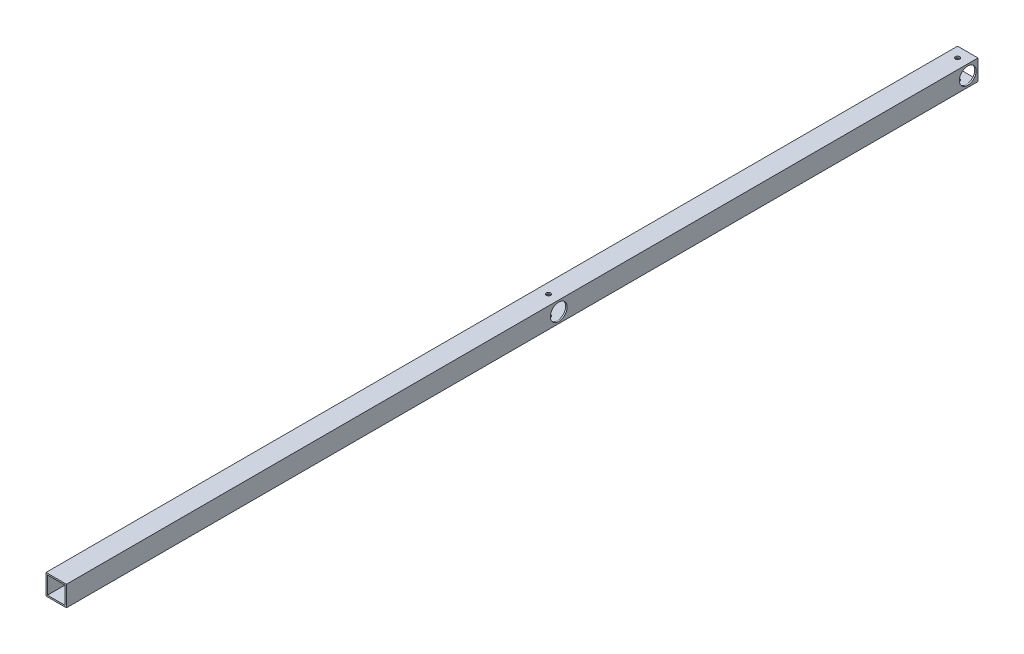
ISO-10303-21;
HEADER;
FILE_DESCRIPTION(('STEP AP214'),'2;1');
FILE_NAME('part.step','',(''),(''),'','','');
FILE_SCHEMA(('AUTOMOTIVE_DESIGN { 1 0 10303 214 1 1 1 1 }'));
ENDSEC;
DATA;
#1=APPLICATION_CONTEXT('core data for automotive mechanical design processes');
#2=APPLICATION_PROTOCOL_DEFINITION('international standard','automotive_design',2000,#1);
#3=PRODUCT_CONTEXT('',#1,'mechanical');
#4=PRODUCT('Part','Part','',(#3));
#5=PRODUCT_RELATED_PRODUCT_CATEGORY('part','',(#4));
#6=PRODUCT_DEFINITION_FORMATION('','',#4);
#7=PRODUCT_DEFINITION_CONTEXT('part definition',#1,'design');
#8=PRODUCT_DEFINITION('design','',#6,#7);
#9=PRODUCT_DEFINITION_SHAPE('','',#8);
#10=(LENGTH_UNIT() NAMED_UNIT(*) SI_UNIT(.MILLI.,.METRE.));
#11=(NAMED_UNIT(*) PLANE_ANGLE_UNIT() SI_UNIT($,.RADIAN.));
#12=(NAMED_UNIT(*) SI_UNIT($,.STERADIAN.) SOLID_ANGLE_UNIT());
#13=UNCERTAINTY_MEASURE_WITH_UNIT(LENGTH_MEASURE(1.E-05),#10,'distance_accuracy_value','');
#14=(GEOMETRIC_REPRESENTATION_CONTEXT(3) GLOBAL_UNCERTAINTY_ASSIGNED_CONTEXT((#13)) GLOBAL_UNIT_ASSIGNED_CONTEXT((#10,
#11,#12)) REPRESENTATION_CONTEXT('',''));
#15=CARTESIAN_POINT('',(0.,0.,0.));
#16=DIRECTION('',(0.,0.,1.));
#17=DIRECTION('',(1.,0.,0.));
#18=AXIS2_PLACEMENT_3D('',#15,#16,#17);
#19=CARTESIAN_POINT('',(-9.09282899069231,22.4806190747695,911.225));
#20=DIRECTION('',(0.,-1.,0.));
#21=DIRECTION('',(0.,0.,-1.));
#22=AXIS2_PLACEMENT_3D('',#19,#20,#21);
#23=CYLINDRICAL_SURFACE('',#22,4.7625);
#24=CARTESIAN_POINT('',(-9.09282899069231,22.4806190747695,911.225));
#25=DIRECTION('',(0.,-1.,0.));
#26=DIRECTION('',(0.,0.,-1.));
#27=AXIS2_PLACEMENT_3D('',#24,#25,#26);
#28=CIRCLE('',#27,4.7625);
#29=CARTESIAN_POINT('',(-9.09282899069231,22.4806190747695,906.4625));
#30=VERTEX_POINT('',#29);
#31=EDGE_CURVE('E152',#30,#30,#28,.T.);
#32=ORIENTED_EDGE('',*,*,#31,.F.);
#33=EDGE_LOOP('',(#32));
#34=FACE_BOUND('',#33,.T.);
#35=CARTESIAN_POINT('',(-9.09282899069231,19.3056190747695,911.225));
#36=DIRECTION('',(0.,-1.,0.));
#37=DIRECTION('',(0.,0.,-1.));
#38=AXIS2_PLACEMENT_3D('',#35,#36,#37);
#39=CIRCLE('',#38,4.7625);
#40=CARTESIAN_POINT('',(-9.09282899069231,19.3056190747695,906.4625));
#41=VERTEX_POINT('',#40);
#42=EDGE_CURVE('E20',#41,#41,#39,.T.);
#43=ORIENTED_EDGE('',*,*,#42,.T.);
#44=EDGE_LOOP('',(#43));
#45=FACE_BOUND('',#44,.T.);
#46=ADVANCED_FACE('F17',(#34,#45),#23,.F.);
#47=CARTESIAN_POINT('',(-9.09282899069231,22.4806190747695,22.2250000000001));
#48=DIRECTION('',(0.,-1.,0.));
#49=DIRECTION('',(0.,0.,-1.));
#50=AXIS2_PLACEMENT_3D('',#47,#48,#49);
#51=CYLINDRICAL_SURFACE('',#50,4.7625);
#52=CARTESIAN_POINT('',(-9.09282899069231,22.4806190747695,22.2250000000001));
#53=DIRECTION('',(0.,-1.,0.));
#54=DIRECTION('',(0.,0.,-1.));
#55=AXIS2_PLACEMENT_3D('',#52,#53,#54);
#56=CIRCLE('',#55,4.7625);
#57=CARTESIAN_POINT('',(-9.09282899069231,22.4806190747695,17.4625000000001));
#58=VERTEX_POINT('',#57);
#59=EDGE_CURVE('E149',#58,#58,#56,.T.);
#60=ORIENTED_EDGE('',*,*,#59,.F.);
#61=EDGE_LOOP('',(#60));
#62=FACE_BOUND('',#61,.T.);
#63=CARTESIAN_POINT('',(-9.09282899069231,19.3056190747695,22.2250000000001));
#64=DIRECTION('',(0.,-1.,0.));
#65=DIRECTION('',(0.,0.,-1.));
#66=AXIS2_PLACEMENT_3D('',#63,#64,#65);
#67=CIRCLE('',#66,4.7625);
#68=CARTESIAN_POINT('',(-9.09282899069231,19.3056190747695,17.4625000000001));
#69=VERTEX_POINT('',#68);
#70=EDGE_CURVE('E116',#69,#69,#67,.T.);
#71=ORIENTED_EDGE('',*,*,#70,.T.);
#72=EDGE_LOOP('',(#71));
#73=FACE_BOUND('',#72,.T.);
#74=ADVANCED_FACE('F283',(#62,#73),#51,.F.);
#75=CARTESIAN_POINT('',(13.1321710093077,0.25561907476954,911.225));
#76=DIRECTION('',(-1.,0.,0.));
#77=DIRECTION('',(0.,-1.,0.));
#78=AXIS2_PLACEMENT_3D('',#75,#76,#77);
#79=CYLINDRICAL_SURFACE('',#78,18.25625);
#80=CARTESIAN_POINT('',(9.95717100930769,0.25561907476954,911.225));
#81=DIRECTION('',(-1.,0.,0.));
#82=DIRECTION('',(0.,-1.,0.));
#83=AXIS2_PLACEMENT_3D('',#80,#81,#82);
#84=CIRCLE('',#83,18.25625);
#85=CARTESIAN_POINT('',(9.95717100930769,-18.0006309252305,911.225));
#86=VERTEX_POINT('',#85);
#87=EDGE_CURVE('E115',#86,#86,#84,.T.);
#88=ORIENTED_EDGE('',*,*,#87,.T.);
#89=EDGE_LOOP('',(#88));
#90=FACE_BOUND('',#89,.T.);
#91=CARTESIAN_POINT('',(13.1321710093077,0.25561907476954,911.225));
#92=DIRECTION('',(-1.,0.,0.));
#93=DIRECTION('',(0.,-1.,0.));
#94=AXIS2_PLACEMENT_3D('',#91,#92,#93);
#95=CIRCLE('',#94,18.25625);
#96=CARTESIAN_POINT('',(13.1321710093077,-18.0006309252305,911.225));
#97=VERTEX_POINT('',#96);
#98=EDGE_CURVE('E140',#97,#97,#95,.T.);
#99=ORIENTED_EDGE('',*,*,#98,.F.);
#100=EDGE_LOOP('',(#99));
#101=FACE_BOUND('',#100,.T.);
#102=ADVANCED_FACE('F280',(#90,#101),#79,.F.);
#103=CARTESIAN_POINT('',(13.1321710093077,0.25561907476954,22.225));
#104=DIRECTION('',(-1.,0.,0.));
#105=DIRECTION('',(0.,-1.,0.));
#106=AXIS2_PLACEMENT_3D('',#103,#104,#105);
#107=CYLINDRICAL_SURFACE('',#106,18.25625);
#108=CARTESIAN_POINT('',(9.95717100930769,0.25561907476954,22.225));
#109=DIRECTION('',(-1.,0.,0.));
#110=DIRECTION('',(0.,-1.,0.));
#111=AXIS2_PLACEMENT_3D('',#108,#109,#110);
#112=CIRCLE('',#111,18.25625);
#113=CARTESIAN_POINT('',(9.95717100930769,-18.0006309252305,22.225));
#114=VERTEX_POINT('',#113);
#115=EDGE_CURVE('E155',#114,#114,#112,.T.);
#116=ORIENTED_EDGE('',*,*,#115,.T.);
#117=EDGE_LOOP('',(#116));
#118=FACE_BOUND('',#117,.T.);
#119=CARTESIAN_POINT('',(13.1321710093077,0.25561907476954,22.225));
#120=DIRECTION('',(-1.,0.,0.));
#121=DIRECTION('',(0.,-1.,0.));
#122=AXIS2_PLACEMENT_3D('',#119,#120,#121);
#123=CIRCLE('',#122,18.25625);
#124=CARTESIAN_POINT('',(13.1321710093077,-18.0006309252305,22.225));
#125=VERTEX_POINT('',#124);
#126=EDGE_CURVE('E136',#125,#125,#123,.T.);
#127=ORIENTED_EDGE('',*,*,#126,.F.);
#128=EDGE_LOOP('',(#127));
#129=FACE_BOUND('',#128,.T.);
#130=ADVANCED_FACE('F276',(#118,#129),#107,.F.);
#131=CARTESIAN_POINT('',(-28.1428289906922,-21.9693809252305,0.));
#132=DIRECTION('',(-1.,0.,0.));
#133=DIRECTION('',(0.,0.,1.));
#134=AXIS2_PLACEMENT_3D('',#131,#132,#133);
#135=PLANE('',#134);
#136=CARTESIAN_POINT('',(-28.1428289906922,0.255619074769538,22.225));
#137=DIRECTION('',(-1.,0.,0.));
#138=DIRECTION('',(0.,-1.,0.));
#139=AXIS2_PLACEMENT_3D('',#136,#137,#138);
#140=CIRCLE('',#139,18.25625);
#141=CARTESIAN_POINT('',(-28.1428289906922,-18.0006309252305,22.225));
#142=VERTEX_POINT('',#141);
#143=EDGE_CURVE('E113',#142,#142,#140,.T.);
#144=ORIENTED_EDGE('',*,*,#143,.T.);
#145=EDGE_LOOP('',(#144));
#146=FACE_BOUND('',#145,.T.);
#147=CARTESIAN_POINT('',(-28.1428289906922,0.255619074769538,911.225));
#148=DIRECTION('',(-1.,0.,0.));
#149=DIRECTION('',(0.,-1.,0.));
#150=AXIS2_PLACEMENT_3D('',#147,#148,#149);
#151=CIRCLE('',#150,18.25625);
#152=CARTESIAN_POINT('',(-28.1428289906922,-18.0006309252305,911.225));
#153=VERTEX_POINT('',#152);
#154=EDGE_CURVE('E146',#153,#153,#151,.T.);
#155=ORIENTED_EDGE('',*,*,#154,.T.);
#156=EDGE_LOOP('',(#155));
#157=FACE_BOUND('',#156,.T.);
#158=DIRECTION('',(0.,1.,0.));
#159=VECTOR('',#158,1.);
#160=CARTESIAN_POINT('',(-28.1428289906922,0.25561907476954,0.));
#161=LINE('',#160,#159);
#162=CARTESIAN_POINT('',(-28.1428289906922,-18.7943809252305,0.));
#163=VERTEX_POINT('',#162);
#164=CARTESIAN_POINT('',(-28.1428289906922,19.3056190747695,0.));
#165=VERTEX_POINT('',#164);
#166=EDGE_CURVE('E105',#163,#165,#161,.T.);
#167=ORIENTED_EDGE('',*,*,#166,.T.);
#168=DIRECTION('',(0.,0.,1.));
#169=VECTOR('',#168,1.);
#170=CARTESIAN_POINT('',(-28.1428289906922,19.3056190747695,0.));
#171=LINE('',#170,#169);
#172=CARTESIAN_POINT('',(-28.1428289906922,19.3056190747695,1981.2));
#173=VERTEX_POINT('',#172);
#174=EDGE_CURVE('E117',#165,#173,#171,.T.);
#175=ORIENTED_EDGE('',*,*,#174,.T.);
#176=DIRECTION('',(0.,1.,0.));
#177=VECTOR('',#176,1.);
#178=CARTESIAN_POINT('',(-28.1428289906922,0.25561907476954,1981.2));
#179=LINE('',#178,#177);
#180=CARTESIAN_POINT('',(-28.1428289906922,-18.7943809252305,1981.2));
#181=VERTEX_POINT('',#180);
#182=EDGE_CURVE('E183',#181,#173,#179,.T.);
#183=ORIENTED_EDGE('',*,*,#182,.F.);
#184=DIRECTION('',(0.,0.,-1.));
#185=VECTOR('',#184,1.);
#186=CARTESIAN_POINT('',(-28.1428289906922,-18.7943809252305,0.));
#187=LINE('',#186,#185);
#188=EDGE_CURVE('E101',#181,#163,#187,.T.);
#189=ORIENTED_EDGE('',*,*,#188,.T.);
#190=EDGE_LOOP('',(#167,#175,#183,#189));
#191=FACE_BOUND('',#190,.T.);
#192=ADVANCED_FACE('F169',(#146,#157,#191),#135,.F.);
#193=CARTESIAN_POINT('',(-31.3178289906922,19.3056190747695,0.));
#194=DIRECTION('',(0.,1.,0.));
#195=DIRECTION('',(0.,0.,1.));
#196=AXIS2_PLACEMENT_3D('',#193,#194,#195);
#197=PLANE('',#196);
#198=ORIENTED_EDGE('',*,*,#70,.F.);
#199=EDGE_LOOP('',(#198));
#200=FACE_BOUND('',#199,.T.);
#201=ORIENTED_EDGE('',*,*,#42,.F.);
#202=EDGE_LOOP('',(#201));
#203=FACE_BOUND('',#202,.T.);
#204=DIRECTION('',(1.,0.,0.));
#205=VECTOR('',#204,1.);
#206=CARTESIAN_POINT('',(-9.09282899069231,19.3056190747695,0.));
#207=LINE('',#206,#205);
#208=CARTESIAN_POINT('',(9.95717100930769,19.3056190747695,0.));
#209=VERTEX_POINT('',#208);
#210=EDGE_CURVE('E107',#165,#209,#207,.T.);
#211=ORIENTED_EDGE('',*,*,#210,.T.);
#212=DIRECTION('',(0.,0.,-1.));
#213=VECTOR('',#212,1.);
#214=CARTESIAN_POINT('',(9.95717100930769,19.3056190747695,0.));
#215=LINE('',#214,#213);
#216=CARTESIAN_POINT('',(9.95717100930769,19.3056190747695,1981.2));
#217=VERTEX_POINT('',#216);
#218=EDGE_CURVE('E79',#209,#217,#215,.F.);
#219=ORIENTED_EDGE('',*,*,#218,.T.);
#220=DIRECTION('',(1.,0.,0.));
#221=VECTOR('',#220,1.);
#222=CARTESIAN_POINT('',(-9.09282899069231,19.3056190747695,1981.2));
#223=LINE('',#222,#221);
#224=EDGE_CURVE('E186',#173,#217,#223,.T.);
#225=ORIENTED_EDGE('',*,*,#224,.F.);
#226=ORIENTED_EDGE('',*,*,#174,.F.);
#227=EDGE_LOOP('',(#211,#219,#225,#226));
#228=FACE_BOUND('',#227,.T.);
#229=ADVANCED_FACE('F166',(#200,#203,#228),#197,.F.);
#230=CARTESIAN_POINT('',(9.95717100930769,22.4806190747695,0.));
#231=DIRECTION('',(1.,0.,0.));
#232=DIRECTION('',(0.,0.,-1.));
#233=AXIS2_PLACEMENT_3D('',#230,#231,#232);
#234=PLANE('',#233);
#235=ORIENTED_EDGE('',*,*,#115,.F.);
#236=EDGE_LOOP('',(#235));
#237=FACE_BOUND('',#236,.T.);
#238=ORIENTED_EDGE('',*,*,#87,.F.);
#239=EDGE_LOOP('',(#238));
#240=FACE_BOUND('',#239,.T.);
#241=DIRECTION('',(0.,1.,0.));
#242=VECTOR('',#241,1.);
#243=CARTESIAN_POINT('',(9.95717100930769,0.25561907476954,0.));
#244=LINE('',#243,#242);
#245=CARTESIAN_POINT('',(9.95717100930769,-18.7943809252305,0.));
#246=VERTEX_POINT('',#245);
#247=EDGE_CURVE('E82',#209,#246,#244,.F.);
#248=ORIENTED_EDGE('',*,*,#247,.T.);
#249=DIRECTION('',(0.,0.,-1.));
#250=VECTOR('',#249,1.);
#251=CARTESIAN_POINT('',(9.95717100930769,-18.7943809252305,0.));
#252=LINE('',#251,#250);
#253=CARTESIAN_POINT('',(9.95717100930769,-18.7943809252305,1981.2));
#254=VERTEX_POINT('',#253);
#255=EDGE_CURVE('E85',#246,#254,#252,.F.);
#256=ORIENTED_EDGE('',*,*,#255,.T.);
#257=DIRECTION('',(0.,1.,0.));
#258=VECTOR('',#257,1.);
#259=CARTESIAN_POINT('',(9.95717100930769,0.25561907476954,1981.2));
#260=LINE('',#259,#258);
#261=EDGE_CURVE('E189',#217,#254,#260,.F.);
#262=ORIENTED_EDGE('',*,*,#261,.F.);
#263=ORIENTED_EDGE('',*,*,#218,.F.);
#264=EDGE_LOOP('',(#248,#256,#262,#263));
#265=FACE_BOUND('',#264,.T.);
#266=ADVANCED_FACE('F84',(#237,#240,#265),#234,.F.);
#267=CARTESIAN_POINT('',(-31.3178289906922,22.4806190747695,0.));
#268=DIRECTION('',(0.,1.,0.));
#269=DIRECTION('',(0.,0.,1.));
#270=AXIS2_PLACEMENT_3D('',#267,#268,#269);
#271=PLANE('',#270);
#272=ORIENTED_EDGE('',*,*,#59,.T.);
#273=EDGE_LOOP('',(#272));
#274=FACE_BOUND('',#273,.T.);
#275=ORIENTED_EDGE('',*,*,#31,.T.);
#276=EDGE_LOOP('',(#275));
#277=FACE_BOUND('',#276,.T.);
#278=DIRECTION('',(1.,0.,0.));
#279=VECTOR('',#278,1.);
#280=CARTESIAN_POINT('',(-9.09282899069231,22.4806190747695,1981.2));
#281=LINE('',#280,#279);
#282=CARTESIAN_POINT('',(13.1321710093077,22.4806190747695,1981.2));
#283=VERTEX_POINT('',#282);
#284=CARTESIAN_POINT('',(-31.3178289906922,22.4806190747695,1981.2));
#285=VERTEX_POINT('',#284);
#286=EDGE_CURVE('E181',#283,#285,#281,.F.);
#287=ORIENTED_EDGE('',*,*,#286,.F.);
#288=DIRECTION('',(0.,0.,-1.));
#289=VECTOR('',#288,1.);
#290=CARTESIAN_POINT('',(13.1321710093077,22.4806190747695,0.));
#291=LINE('',#290,#289);
#292=CARTESIAN_POINT('',(13.1321710093077,22.4806190747695,0.));
#293=VERTEX_POINT('',#292);
#294=EDGE_CURVE('E143',#293,#283,#291,.F.);
#295=ORIENTED_EDGE('',*,*,#294,.F.);
#296=DIRECTION('',(1.,0.,0.));
#297=VECTOR('',#296,1.);
#298=CARTESIAN_POINT('',(-9.09282899069231,22.4806190747695,0.));
#299=LINE('',#298,#297);
#300=CARTESIAN_POINT('',(-31.3178289906922,22.4806190747695,0.));
#301=VERTEX_POINT('',#300);
#302=EDGE_CURVE('E91',#293,#301,#299,.F.);
#303=ORIENTED_EDGE('',*,*,#302,.T.);
#304=DIRECTION('',(0.,0.,1.));
#305=VECTOR('',#304,1.);
#306=CARTESIAN_POINT('',(-31.3178289906922,22.4806190747695,0.));
#307=LINE('',#306,#305);
#308=EDGE_CURVE('E135',#285,#301,#307,.F.);
#309=ORIENTED_EDGE('',*,*,#308,.F.);
#310=EDGE_LOOP('',(#287,#295,#303,#309));
#311=FACE_BOUND('',#310,.T.);
#312=ADVANCED_FACE('F266',(#274,#277,#311),#271,.T.);
#313=CARTESIAN_POINT('',(13.1321710093077,0.25561907476954,911.225));
#314=DIRECTION('',(-1.,0.,0.));
#315=DIRECTION('',(0.,-1.,0.));
#316=AXIS2_PLACEMENT_3D('',#313,#314,#315);
#317=CYLINDRICAL_SURFACE('',#316,18.25625);
#318=CARTESIAN_POINT('',(-31.3178289906922,0.255619074769538,911.225));
#319=DIRECTION('',(-1.,0.,0.));
#320=DIRECTION('',(0.,-1.,0.));
#321=AXIS2_PLACEMENT_3D('',#318,#319,#320);
#322=CIRCLE('',#321,18.25625);
#323=CARTESIAN_POINT('',(-31.3178289906922,-18.0006309252305,911.225));
#324=VERTEX_POINT('',#323);
#325=EDGE_CURVE('E132',#324,#324,#322,.F.);
#326=ORIENTED_EDGE('',*,*,#325,.F.);
#327=EDGE_LOOP('',(#326));
#328=FACE_BOUND('',#327,.T.);
#329=ORIENTED_EDGE('',*,*,#154,.F.);
#330=EDGE_LOOP('',(#329));
#331=FACE_BOUND('',#330,.T.);
#332=ADVANCED_FACE('F260',(#328,#331),#317,.F.);
#333=CARTESIAN_POINT('',(13.1321710093077,0.25561907476954,22.225));
#334=DIRECTION('',(-1.,0.,0.));
#335=DIRECTION('',(0.,-1.,0.));
#336=AXIS2_PLACEMENT_3D('',#333,#334,#335);
#337=CYLINDRICAL_SURFACE('',#336,18.25625);
#338=CARTESIAN_POINT('',(-31.3178289906922,0.255619074769538,22.225));
#339=DIRECTION('',(-1.,0.,0.));
#340=DIRECTION('',(0.,-1.,0.));
#341=AXIS2_PLACEMENT_3D('',#338,#339,#340);
#342=CIRCLE('',#341,18.25625);
#343=CARTESIAN_POINT('',(-31.3178289906922,-18.0006309252305,22.225));
#344=VERTEX_POINT('',#343);
#345=EDGE_CURVE('E129',#344,#344,#342,.F.);
#346=ORIENTED_EDGE('',*,*,#345,.F.);
#347=EDGE_LOOP('',(#346));
#348=FACE_BOUND('',#347,.T.);
#349=ORIENTED_EDGE('',*,*,#143,.F.);
#350=EDGE_LOOP('',(#349));
#351=FACE_BOUND('',#350,.T.);
#352=ADVANCED_FACE('F252',(#348,#351),#337,.F.);
#353=CARTESIAN_POINT('',(13.1321710093077,-18.7943809252305,0.));
#354=DIRECTION('',(0.,-1.,0.));
#355=DIRECTION('',(0.,0.,-1.));
#356=AXIS2_PLACEMENT_3D('',#353,#354,#355);
#357=PLANE('',#356);
#358=CARTESIAN_POINT('',(-9.09282899069231,-18.7943809252305,22.2250000000001));
#359=DIRECTION('',(0.,-1.,0.));
#360=DIRECTION('',(0.,0.,-1.));
#361=AXIS2_PLACEMENT_3D('',#358,#359,#360);
#362=CIRCLE('',#361,4.7625);
#363=CARTESIAN_POINT('',(-9.09282899069231,-18.7943809252305,17.4625000000001));
#364=VERTEX_POINT('',#363);
#365=EDGE_CURVE('E122',#364,#364,#362,.T.);
#366=ORIENTED_EDGE('',*,*,#365,.T.);
#367=EDGE_LOOP('',(#366));
#368=FACE_BOUND('',#367,.T.);
#369=CARTESIAN_POINT('',(-9.09282899069231,-18.7943809252305,911.225));
#370=DIRECTION('',(0.,-1.,0.));
#371=DIRECTION('',(0.,0.,-1.));
#372=AXIS2_PLACEMENT_3D('',#369,#370,#371);
#373=CIRCLE('',#372,4.7625);
#374=CARTESIAN_POINT('',(-9.09282899069231,-18.7943809252305,906.4625));
#375=VERTEX_POINT('',#374);
#376=EDGE_CURVE('E126',#375,#375,#373,.T.);
#377=ORIENTED_EDGE('',*,*,#376,.T.);
#378=EDGE_LOOP('',(#377));
#379=FACE_BOUND('',#378,.T.);
#380=DIRECTION('',(1.,0.,0.));
#381=VECTOR('',#380,1.);
#382=CARTESIAN_POINT('',(-9.09282899069231,-18.7943809252305,0.));
#383=LINE('',#382,#381);
#384=EDGE_CURVE('E90',#246,#163,#383,.F.);
#385=ORIENTED_EDGE('',*,*,#384,.T.);
#386=ORIENTED_EDGE('',*,*,#188,.F.);
#387=DIRECTION('',(1.,0.,0.));
#388=VECTOR('',#387,1.);
#389=CARTESIAN_POINT('',(-9.09282899069231,-18.7943809252305,1981.2));
#390=LINE('',#389,#388);
#391=EDGE_CURVE('E99',#254,#181,#390,.F.);
#392=ORIENTED_EDGE('',*,*,#391,.F.);
#393=ORIENTED_EDGE('',*,*,#255,.F.);
#394=EDGE_LOOP('',(#385,#386,#392,#393));
#395=FACE_BOUND('',#394,.T.);
#396=ADVANCED_FACE('F95',(#368,#379,#395),#357,.F.);
#397=CARTESIAN_POINT('',(-9.09282899069231,0.25561907476954,0.));
#398=DIRECTION('',(0.,0.,1.));
#399=DIRECTION('',(1.,0.,0.));
#400=AXIS2_PLACEMENT_3D('',#397,#398,#399);
#401=PLANE('',#400);
#402=ORIENTED_EDGE('',*,*,#166,.F.);
#403=ORIENTED_EDGE('',*,*,#384,.F.);
#404=ORIENTED_EDGE('',*,*,#247,.F.);
#405=ORIENTED_EDGE('',*,*,#210,.F.);
#406=EDGE_LOOP('',(#402,#403,#404,#405));
#407=FACE_BOUND('',#406,.T.);
#408=DIRECTION('',(1.,0.,0.));
#409=VECTOR('',#408,1.);
#410=CARTESIAN_POINT('',(13.1321710093077,-21.9693809252305,0.));
#411=LINE('',#410,#409);
#412=CARTESIAN_POINT('',(-31.3178289906922,-21.9693809252305,0.));
#413=VERTEX_POINT('',#412);
#414=CARTESIAN_POINT('',(13.1321710093077,-21.9693809252305,0.));
#415=VERTEX_POINT('',#414);
#416=EDGE_CURVE('E125',#413,#415,#411,.T.);
#417=ORIENTED_EDGE('',*,*,#416,.F.);
#418=DIRECTION('',(0.,1.,0.));
#419=VECTOR('',#418,1.);
#420=CARTESIAN_POINT('',(-31.3178289906922,-21.9693809252305,0.));
#421=LINE('',#420,#419);
#422=EDGE_CURVE('E192',#301,#413,#421,.F.);
#423=ORIENTED_EDGE('',*,*,#422,.F.);
#424=ORIENTED_EDGE('',*,*,#302,.F.);
#425=DIRECTION('',(0.,1.,0.));
#426=VECTOR('',#425,1.);
#427=CARTESIAN_POINT('',(13.1321710093077,22.4806190747695,0.));
#428=LINE('',#427,#426);
#429=EDGE_CURVE('E174',#415,#293,#428,.T.);
#430=ORIENTED_EDGE('',*,*,#429,.F.);
#431=EDGE_LOOP('',(#417,#423,#424,#430));
#432=FACE_BOUND('',#431,.T.);
#433=ADVANCED_FACE('F103',(#407,#432),#401,.F.);
#434=CARTESIAN_POINT('',(13.1321710093077,22.4806190747695,0.));
#435=DIRECTION('',(1.,0.,0.));
#436=DIRECTION('',(0.,0.,-1.));
#437=AXIS2_PLACEMENT_3D('',#434,#435,#436);
#438=PLANE('',#437);
#439=ORIENTED_EDGE('',*,*,#126,.T.);
#440=EDGE_LOOP('',(#439));
#441=FACE_BOUND('',#440,.T.);
#442=ORIENTED_EDGE('',*,*,#98,.T.);
#443=EDGE_LOOP('',(#442));
#444=FACE_BOUND('',#443,.T.);
#445=DIRECTION('',(0.,1.,0.));
#446=VECTOR('',#445,1.);
#447=CARTESIAN_POINT('',(13.1321710093077,0.25561907476954,1981.2));
#448=LINE('',#447,#446);
#449=CARTESIAN_POINT('',(13.1321710093077,-21.9693809252305,1981.2));
#450=VERTEX_POINT('',#449);
#451=EDGE_CURVE('E139',#450,#283,#448,.T.);
#452=ORIENTED_EDGE('',*,*,#451,.F.);
#453=DIRECTION('',(0.,0.,-1.));
#454=VECTOR('',#453,1.);
#455=CARTESIAN_POINT('',(13.1321710093077,-21.9693809252305,0.));
#456=LINE('',#455,#454);
#457=EDGE_CURVE('E200',#415,#450,#456,.F.);
#458=ORIENTED_EDGE('',*,*,#457,.F.);
#459=ORIENTED_EDGE('',*,*,#429,.T.);
#460=ORIENTED_EDGE('',*,*,#294,.T.);
#461=EDGE_LOOP('',(#452,#458,#459,#460));
#462=FACE_BOUND('',#461,.T.);
#463=ADVANCED_FACE('F216',(#441,#444,#462),#438,.T.);
#464=CARTESIAN_POINT('',(-9.09282899069231,0.25561907476954,1981.2));
#465=DIRECTION('',(0.,0.,1.));
#466=DIRECTION('',(1.,0.,0.));
#467=AXIS2_PLACEMENT_3D('',#464,#465,#466);
#468=PLANE('',#467);
#469=ORIENTED_EDGE('',*,*,#261,.T.);
#470=ORIENTED_EDGE('',*,*,#391,.T.);
#471=ORIENTED_EDGE('',*,*,#182,.T.);
#472=ORIENTED_EDGE('',*,*,#224,.T.);
#473=EDGE_LOOP('',(#469,#470,#471,#472));
#474=FACE_BOUND('',#473,.T.);
#475=ORIENTED_EDGE('',*,*,#451,.T.);
#476=ORIENTED_EDGE('',*,*,#286,.T.);
#477=DIRECTION('',(0.,1.,0.));
#478=VECTOR('',#477,1.);
#479=CARTESIAN_POINT('',(-31.3178289906922,-21.9693809252305,1981.2));
#480=LINE('',#479,#478);
#481=CARTESIAN_POINT('',(-31.3178289906922,-21.9693809252305,1981.2));
#482=VERTEX_POINT('',#481);
#483=EDGE_CURVE('E35',#482,#285,#480,.T.);
#484=ORIENTED_EDGE('',*,*,#483,.F.);
#485=DIRECTION('',(1.,0.,0.));
#486=VECTOR('',#485,1.);
#487=CARTESIAN_POINT('',(13.1321710093077,-21.9693809252305,1981.2));
#488=LINE('',#487,#486);
#489=EDGE_CURVE('E203',#450,#482,#488,.F.);
#490=ORIENTED_EDGE('',*,*,#489,.F.);
#491=EDGE_LOOP('',(#475,#476,#484,#490));
#492=FACE_BOUND('',#491,.T.);
#493=ADVANCED_FACE('F218',(#474,#492),#468,.T.);
#494=CARTESIAN_POINT('',(-31.3178289906922,-21.9693809252305,0.));
#495=DIRECTION('',(-1.,0.,0.));
#496=DIRECTION('',(0.,0.,1.));
#497=AXIS2_PLACEMENT_3D('',#494,#495,#496);
#498=PLANE('',#497);
#499=ORIENTED_EDGE('',*,*,#345,.T.);
#500=EDGE_LOOP('',(#499));
#501=FACE_BOUND('',#500,.T.);
#502=ORIENTED_EDGE('',*,*,#325,.T.);
#503=EDGE_LOOP('',(#502));
#504=FACE_BOUND('',#503,.T.);
#505=ORIENTED_EDGE('',*,*,#483,.T.);
#506=ORIENTED_EDGE('',*,*,#308,.T.);
#507=ORIENTED_EDGE('',*,*,#422,.T.);
#508=DIRECTION('',(0.,0.,-1.));
#509=VECTOR('',#508,1.);
#510=CARTESIAN_POINT('',(-31.3178289906922,-21.9693809252305,0.));
#511=LINE('',#510,#509);
#512=EDGE_CURVE('E121',#482,#413,#511,.T.);
#513=ORIENTED_EDGE('',*,*,#512,.F.);
#514=EDGE_LOOP('',(#505,#506,#507,#513));
#515=FACE_BOUND('',#514,.T.);
#516=ADVANCED_FACE('F210',(#501,#504,#515),#498,.T.);
#517=CARTESIAN_POINT('',(-9.09282899069231,22.4806190747695,911.225));
#518=DIRECTION('',(0.,-1.,0.));
#519=DIRECTION('',(0.,0.,-1.));
#520=AXIS2_PLACEMENT_3D('',#517,#518,#519);
#521=CYLINDRICAL_SURFACE('',#520,4.7625);
#522=ORIENTED_EDGE('',*,*,#376,.F.);
#523=EDGE_LOOP('',(#522));
#524=FACE_BOUND('',#523,.T.);
#525=CARTESIAN_POINT('',(-9.09282899069231,-21.9693809252305,911.225));
#526=DIRECTION('',(0.,-1.,0.));
#527=DIRECTION('',(0.,0.,-1.));
#528=AXIS2_PLACEMENT_3D('',#525,#526,#527);
#529=CIRCLE('',#528,4.7625);
#530=CARTESIAN_POINT('',(-9.09282899069231,-21.9693809252305,906.4625));
#531=VERTEX_POINT('',#530);
#532=EDGE_CURVE('E26',#531,#531,#529,.F.);
#533=ORIENTED_EDGE('',*,*,#532,.F.);
#534=EDGE_LOOP('',(#533));
#535=FACE_BOUND('',#534,.T.);
#536=ADVANCED_FACE('F227',(#524,#535),#521,.F.);
#537=CARTESIAN_POINT('',(-9.09282899069231,22.4806190747695,22.2250000000001));
#538=DIRECTION('',(0.,-1.,0.));
#539=DIRECTION('',(0.,0.,-1.));
#540=AXIS2_PLACEMENT_3D('',#537,#538,#539);
#541=CYLINDRICAL_SURFACE('',#540,4.7625);
#542=ORIENTED_EDGE('',*,*,#365,.F.);
#543=EDGE_LOOP('',(#542));
#544=FACE_BOUND('',#543,.T.);
#545=CARTESIAN_POINT('',(-9.09282899069231,-21.9693809252305,22.2250000000001));
#546=DIRECTION('',(0.,-1.,0.));
#547=DIRECTION('',(0.,0.,-1.));
#548=AXIS2_PLACEMENT_3D('',#545,#546,#547);
#549=CIRCLE('',#548,4.7625);
#550=CARTESIAN_POINT('',(-9.09282899069231,-21.9693809252305,17.4625000000001));
#551=VERTEX_POINT('',#550);
#552=EDGE_CURVE('E11',#551,#551,#549,.F.);
#553=ORIENTED_EDGE('',*,*,#552,.F.);
#554=EDGE_LOOP('',(#553));
#555=FACE_BOUND('',#554,.T.);
#556=ADVANCED_FACE('F233',(#544,#555),#541,.F.);
#557=CARTESIAN_POINT('',(13.1321710093077,-21.9693809252305,0.));
#558=DIRECTION('',(0.,-1.,0.));
#559=DIRECTION('',(0.,0.,-1.));
#560=AXIS2_PLACEMENT_3D('',#557,#558,#559);
#561=PLANE('',#560);
#562=ORIENTED_EDGE('',*,*,#552,.T.);
#563=EDGE_LOOP('',(#562));
#564=FACE_BOUND('',#563,.T.);
#565=ORIENTED_EDGE('',*,*,#532,.T.);
#566=EDGE_LOOP('',(#565));
#567=FACE_BOUND('',#566,.T.);
#568=ORIENTED_EDGE('',*,*,#489,.T.);
#569=ORIENTED_EDGE('',*,*,#512,.T.);
#570=ORIENTED_EDGE('',*,*,#416,.T.);
#571=ORIENTED_EDGE('',*,*,#457,.T.);
#572=EDGE_LOOP('',(#568,#569,#570,#571));
#573=FACE_BOUND('',#572,.T.);
#574=ADVANCED_FACE('F208',(#564,#567,#573),#561,.T.);
#575=CLOSED_SHELL('',(#46,#74,#102,#130,#192,#229,#266,#312,#332,#352,#396,#433,#463,#493,#516,
#536,#556,#574));
#576=MANIFOLD_SOLID_BREP('B1',#575);
#577=ADVANCED_BREP_SHAPE_REPRESENTATION('',(#18,#576),#14);
#578=SHAPE_DEFINITION_REPRESENTATION(#9,#577);
ENDSEC;
END-ISO-10303-21;
